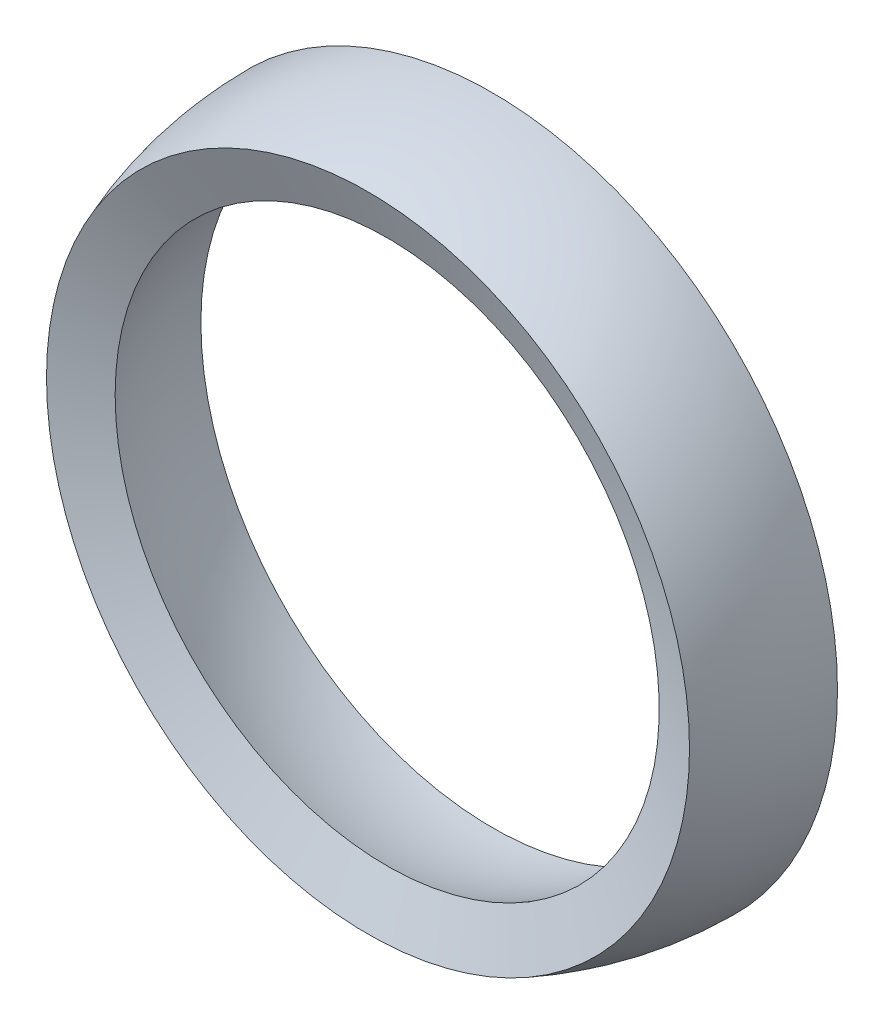
ISO-10303-21;
HEADER;
FILE_DESCRIPTION(('STEP AP214'),'2;1');
FILE_NAME('part.step','',(''),(''),'','','');
FILE_SCHEMA(('AUTOMOTIVE_DESIGN { 1 0 10303 214 1 1 1 1 }'));
ENDSEC;
DATA;
#1=APPLICATION_CONTEXT('core data for automotive mechanical design processes');
#2=APPLICATION_PROTOCOL_DEFINITION('international standard','automotive_design',2000,#1);
#3=PRODUCT_CONTEXT('',#1,'mechanical');
#4=PRODUCT('Part','Part','',(#3));
#5=PRODUCT_RELATED_PRODUCT_CATEGORY('part','',(#4));
#6=PRODUCT_DEFINITION_FORMATION('','',#4);
#7=PRODUCT_DEFINITION_CONTEXT('part definition',#1,'design');
#8=PRODUCT_DEFINITION('design','',#6,#7);
#9=PRODUCT_DEFINITION_SHAPE('','',#8);
#10=(LENGTH_UNIT() NAMED_UNIT(*) SI_UNIT(.MILLI.,.METRE.));
#11=(NAMED_UNIT(*) PLANE_ANGLE_UNIT() SI_UNIT($,.RADIAN.));
#12=(NAMED_UNIT(*) SI_UNIT($,.STERADIAN.) SOLID_ANGLE_UNIT());
#13=UNCERTAINTY_MEASURE_WITH_UNIT(LENGTH_MEASURE(1.E-05),#10,'distance_accuracy_value','');
#14=(GEOMETRIC_REPRESENTATION_CONTEXT(3) GLOBAL_UNCERTAINTY_ASSIGNED_CONTEXT((#13)) GLOBAL_UNIT_ASSIGNED_CONTEXT((#10,
#11,#12)) REPRESENTATION_CONTEXT('',''));
#15=CARTESIAN_POINT('',(0.,0.,0.));
#16=DIRECTION('',(0.,0.,1.));
#17=DIRECTION('',(1.,0.,0.));
#18=AXIS2_PLACEMENT_3D('',#15,#16,#17);
#19=CARTESIAN_POINT('',(0.,0.,0.));
#20=DIRECTION('',(0.,0.,-1.));
#21=DIRECTION('',(-1.,0.,0.));
#22=AXIS2_PLACEMENT_3D('',#19,#20,#21);
#23=SPHERICAL_SURFACE('',#22,26.);
#24=CARTESIAN_POINT('',(0.,0.,9.39983913703748));
#25=DIRECTION('',(0.,0.,-1.));
#26=DIRECTION('',(-1.,0.,0.));
#27=AXIS2_PLACEMENT_3D('',#24,#25,#26);
#28=CIRCLE('',#27,24.2413494714675);
#29=CARTESIAN_POINT('',(-24.2413494714675,0.,9.39983913703748));
#30=VERTEX_POINT('',#29);
#31=EDGE_CURVE('E10',#30,#30,#28,.T.);
#32=ORIENTED_EDGE('',*,*,#31,.T.);
#33=EDGE_LOOP('',(#32));
#34=FACE_BOUND('',#33,.T.);
#35=CARTESIAN_POINT('',(0.,0.,0.));
#36=DIRECTION('',(0.,0.,-1.));
#37=DIRECTION('',(-1.,0.,0.));
#38=AXIS2_PLACEMENT_3D('',#35,#36,#37);
#39=CIRCLE('',#38,26.);
#40=CARTESIAN_POINT('',(-26.,0.,0.));
#41=VERTEX_POINT('',#40);
#42=EDGE_CURVE('E45',#41,#41,#39,.T.);
#43=ORIENTED_EDGE('',*,*,#42,.F.);
#44=EDGE_LOOP('',(#43));
#45=FACE_BOUND('',#44,.T.);
#46=ADVANCED_FACE('F31',(#34,#45),#23,.T.);
#47=CARTESIAN_POINT('',(0.,0.,9.39983913703748));
#48=DIRECTION('',(0.,0.,1.));
#49=DIRECTION('',(1.,0.,0.));
#50=AXIS2_PLACEMENT_3D('',#47,#48,#49);
#51=CONICAL_SURFACE('',#50,24.2413494714675,1.20088551867119);
#52=CARTESIAN_POINT('',(0.,0.,7.95371003903171));
#53=DIRECTION('',(0.,0.,-1.));
#54=DIRECTION('',(-1.,0.,0.));
#55=AXIS2_PLACEMENT_3D('',#52,#53,#54);
#56=CIRCLE('',#55,20.5119110912417);
#57=CARTESIAN_POINT('',(-20.5119110912417,0.,7.95371003903171));
#58=VERTEX_POINT('',#57);
#59=EDGE_CURVE('E37',#58,#58,#56,.T.);
#60=ORIENTED_EDGE('',*,*,#59,.T.);
#61=EDGE_LOOP('',(#60));
#62=FACE_BOUND('',#61,.T.);
#63=ORIENTED_EDGE('',*,*,#31,.F.);
#64=EDGE_LOOP('',(#63));
#65=FACE_BOUND('',#64,.T.);
#66=ADVANCED_FACE('F55',(#62,#65),#51,.F.);
#67=CARTESIAN_POINT('',(0.,0.,0.));
#68=DIRECTION('',(0.,0.,-1.));
#69=DIRECTION('',(-1.,0.,0.));
#70=AXIS2_PLACEMENT_3D('',#67,#68,#69);
#71=SPHERICAL_SURFACE('',#70,22.);
#72=CARTESIAN_POINT('',(0.,0.,0.));
#73=DIRECTION('',(0.,0.,-1.));
#74=DIRECTION('',(-1.,0.,0.));
#75=AXIS2_PLACEMENT_3D('',#72,#73,#74);
#76=CIRCLE('',#75,22.);
#77=CARTESIAN_POINT('',(-22.,0.,0.));
#78=VERTEX_POINT('',#77);
#79=EDGE_CURVE('E41',#78,#78,#76,.T.);
#80=ORIENTED_EDGE('',*,*,#79,.T.);
#81=EDGE_LOOP('',(#80));
#82=FACE_BOUND('',#81,.T.);
#83=ORIENTED_EDGE('',*,*,#59,.F.);
#84=EDGE_LOOP('',(#83));
#85=FACE_BOUND('',#84,.T.);
#86=ADVANCED_FACE('F59',(#82,#85),#71,.F.);
#87=CARTESIAN_POINT('',(-22.,0.,0.));
#88=DIRECTION('',(0.,0.,-1.));
#89=DIRECTION('',(-1.,0.,0.));
#90=AXIS2_PLACEMENT_3D('',#87,#88,#89);
#91=PLANE('',#90);
#92=ORIENTED_EDGE('',*,*,#42,.T.);
#93=EDGE_LOOP('',(#92));
#94=FACE_BOUND('',#93,.T.);
#95=ORIENTED_EDGE('',*,*,#79,.F.);
#96=EDGE_LOOP('',(#95));
#97=FACE_BOUND('',#96,.T.);
#98=ADVANCED_FACE('F51',(#94,#97),#91,.T.);
#99=CLOSED_SHELL('',(#46,#66,#86,#98));
#100=MANIFOLD_SOLID_BREP('B2',#99);
#101=ADVANCED_BREP_SHAPE_REPRESENTATION('',(#18,#100),#14);
#102=SHAPE_DEFINITION_REPRESENTATION(#9,#101);
ENDSEC;
END-ISO-10303-21;
